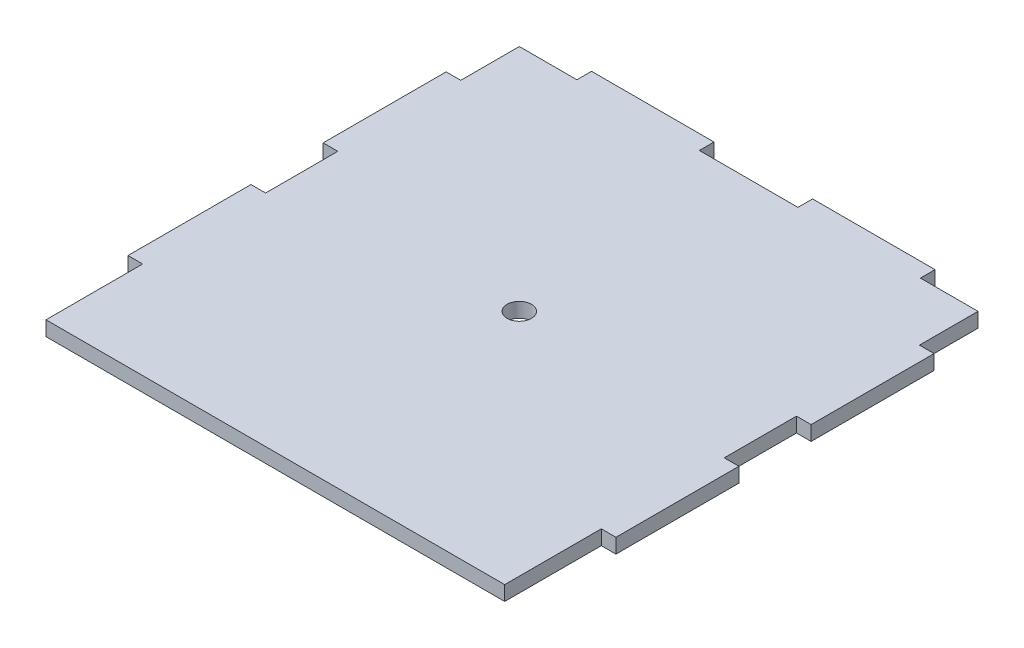
ISO-10303-21;
HEADER;
FILE_DESCRIPTION(('STEP AP214'),'2;1');
FILE_NAME('part.step','',(''),(''),'','','');
FILE_SCHEMA(('AUTOMOTIVE_DESIGN { 1 0 10303 214 1 1 1 1 }'));
ENDSEC;
DATA;
#1=APPLICATION_CONTEXT('core data for automotive mechanical design processes');
#2=APPLICATION_PROTOCOL_DEFINITION('international standard','automotive_design',2000,#1);
#3=PRODUCT_CONTEXT('',#1,'mechanical');
#4=PRODUCT('Part','Part','',(#3));
#5=PRODUCT_RELATED_PRODUCT_CATEGORY('part','',(#4));
#6=PRODUCT_DEFINITION_FORMATION('','',#4);
#7=PRODUCT_DEFINITION_CONTEXT('part definition',#1,'design');
#8=PRODUCT_DEFINITION('design','',#6,#7);
#9=PRODUCT_DEFINITION_SHAPE('','',#8);
#10=(LENGTH_UNIT() NAMED_UNIT(*) SI_UNIT(.MILLI.,.METRE.));
#11=(NAMED_UNIT(*) PLANE_ANGLE_UNIT() SI_UNIT($,.RADIAN.));
#12=(NAMED_UNIT(*) SI_UNIT($,.STERADIAN.) SOLID_ANGLE_UNIT());
#13=UNCERTAINTY_MEASURE_WITH_UNIT(LENGTH_MEASURE(1.E-05),#10,'distance_accuracy_value','');
#14=(GEOMETRIC_REPRESENTATION_CONTEXT(3) GLOBAL_UNCERTAINTY_ASSIGNED_CONTEXT((#13)) GLOBAL_UNIT_ASSIGNED_CONTEXT((#10,
#11,#12)) REPRESENTATION_CONTEXT('',''));
#15=CARTESIAN_POINT('',(0.,0.,0.));
#16=DIRECTION('',(0.,0.,1.));
#17=DIRECTION('',(1.,0.,0.));
#18=AXIS2_PLACEMENT_3D('',#15,#16,#17);
#19=CARTESIAN_POINT('',(0.,3.,-97.));
#20=DIRECTION('',(0.,0.,-1.));
#21=DIRECTION('',(-1.,0.,0.));
#22=AXIS2_PLACEMENT_3D('',#19,#20,#21);
#23=PLANE('',#22);
#24=DIRECTION('',(1.,0.,0.));
#25=VECTOR('',#24,1.);
#26=CARTESIAN_POINT('',(0.,0.,-97.));
#27=LINE('',#26,#25);
#28=CARTESIAN_POINT('',(2.99999999999999,0.,-97.));
#29=VERTEX_POINT('',#28);
#30=CARTESIAN_POINT('',(14.8,0.,-97.));
#31=VERTEX_POINT('',#30);
#32=EDGE_CURVE('E392',#29,#31,#27,.T.);
#33=ORIENTED_EDGE('',*,*,#32,.F.);
#34=DIRECTION('',(0.,-1.,0.));
#35=VECTOR('',#34,1.);
#36=CARTESIAN_POINT('',(2.99999999999999,3.,-97.));
#37=LINE('',#36,#35);
#38=CARTESIAN_POINT('',(2.99999999999999,3.,-97.));
#39=VERTEX_POINT('',#38);
#40=EDGE_CURVE('E11',#39,#29,#37,.T.);
#41=ORIENTED_EDGE('',*,*,#40,.F.);
#42=DIRECTION('',(1.,0.,0.));
#43=VECTOR('',#42,1.);
#44=CARTESIAN_POINT('',(0.,3.,-97.));
#45=LINE('',#44,#43);
#46=CARTESIAN_POINT('',(14.8,3.,-97.));
#47=VERTEX_POINT('',#46);
#48=EDGE_CURVE('E311',#39,#47,#45,.T.);
#49=ORIENTED_EDGE('',*,*,#48,.T.);
#50=DIRECTION('',(0.,-1.,0.));
#51=VECTOR('',#50,1.);
#52=CARTESIAN_POINT('',(14.8,3.,-97.));
#53=LINE('',#52,#51);
#54=EDGE_CURVE('E53',#47,#31,#53,.T.);
#55=ORIENTED_EDGE('',*,*,#54,.T.);
#56=EDGE_LOOP('',(#33,#41,#49,#55));
#57=FACE_BOUND('',#56,.T.);
#58=ADVANCED_FACE('F36',(#57),#23,.T.);
#59=CARTESIAN_POINT('',(3.00000000000066,3.,0.));
#60=DIRECTION('',(1.,0.,0.));
#61=DIRECTION('',(0.,0.,-1.));
#62=AXIS2_PLACEMENT_3D('',#59,#60,#61);
#63=PLANE('',#62);
#64=DIRECTION('',(0.,0.,1.));
#65=VECTOR('',#64,1.);
#66=CARTESIAN_POINT('',(3.00000000000066,0.,0.));
#67=LINE('',#66,#65);
#68=CARTESIAN_POINT('',(3.00000000000007,0.,-84.9999999999998));
#69=VERTEX_POINT('',#68);
#70=EDGE_CURVE('E390',#29,#69,#67,.T.);
#71=ORIENTED_EDGE('',*,*,#70,.T.);
#72=DIRECTION('',(0.,-1.,0.));
#73=VECTOR('',#72,1.);
#74=CARTESIAN_POINT('',(3.00000000000007,3.,-84.9999999999998));
#75=LINE('',#74,#73);
#76=CARTESIAN_POINT('',(3.00000000000007,3.,-84.9999999999998));
#77=VERTEX_POINT('',#76);
#78=EDGE_CURVE('E45',#77,#69,#75,.T.);
#79=ORIENTED_EDGE('',*,*,#78,.F.);
#80=DIRECTION('',(0.,0.,1.));
#81=VECTOR('',#80,1.);
#82=CARTESIAN_POINT('',(3.00000000000066,3.,0.));
#83=LINE('',#82,#81);
#84=EDGE_CURVE('E308',#39,#77,#83,.T.);
#85=ORIENTED_EDGE('',*,*,#84,.F.);
#86=ORIENTED_EDGE('',*,*,#40,.T.);
#87=EDGE_LOOP('',(#71,#79,#85,#86));
#88=FACE_BOUND('',#87,.T.);
#89=ADVANCED_FACE('F391',(#88),#63,.F.);
#90=CARTESIAN_POINT('',(-6.29126380620918E-12,3.,-84.9999999999995));
#91=DIRECTION('',(0.,0.,1.));
#92=DIRECTION('',(1.,0.,0.));
#93=AXIS2_PLACEMENT_3D('',#90,#91,#92);
#94=PLANE('',#93);
#95=DIRECTION('',(-1.,0.,0.));
#96=VECTOR('',#95,1.);
#97=CARTESIAN_POINT('',(-6.29126380620918E-12,0.,-84.9999999999995));
#98=LINE('',#97,#96);
#99=CARTESIAN_POINT('',(0.,0.,-84.9999999999997));
#100=VERTEX_POINT('',#99);
#101=EDGE_CURVE('E386',#69,#100,#98,.T.);
#102=ORIENTED_EDGE('',*,*,#101,.T.);
#103=DIRECTION('',(0.,-1.,0.));
#104=VECTOR('',#103,1.);
#105=CARTESIAN_POINT('',(0.,3.,-84.9999999999997));
#106=LINE('',#105,#104);
#107=CARTESIAN_POINT('',(0.,3.,-84.9999999999997));
#108=VERTEX_POINT('',#107);
#109=EDGE_CURVE('E378',#108,#100,#106,.T.);
#110=ORIENTED_EDGE('',*,*,#109,.F.);
#111=DIRECTION('',(-1.,0.,0.));
#112=VECTOR('',#111,1.);
#113=CARTESIAN_POINT('',(-6.29126380620918E-12,3.,-84.9999999999995));
#114=LINE('',#113,#112);
#115=EDGE_CURVE('E306',#77,#108,#114,.T.);
#116=ORIENTED_EDGE('',*,*,#115,.F.);
#117=ORIENTED_EDGE('',*,*,#78,.T.);
#118=EDGE_LOOP('',(#102,#110,#116,#117));
#119=FACE_BOUND('',#118,.T.);
#120=ADVANCED_FACE('F384',(#119),#94,.F.);
#121=CARTESIAN_POINT('',(0.,3.,0.));
#122=DIRECTION('',(-1.,0.,0.));
#123=DIRECTION('',(0.,0.,1.));
#124=AXIS2_PLACEMENT_3D('',#121,#122,#123);
#125=PLANE('',#124);
#126=DIRECTION('',(0.,0.,-1.));
#127=VECTOR('',#126,1.);
#128=CARTESIAN_POINT('',(0.,0.,0.));
#129=LINE('',#128,#127);
#130=CARTESIAN_POINT('',(0.,0.,-59.7999999999997));
#131=VERTEX_POINT('',#130);
#132=EDGE_CURVE('E394',#131,#100,#129,.T.);
#133=ORIENTED_EDGE('',*,*,#132,.F.);
#134=DIRECTION('',(0.,-1.,0.));
#135=VECTOR('',#134,1.);
#136=CARTESIAN_POINT('',(0.,3.,-59.7999999999997));
#137=LINE('',#136,#135);
#138=CARTESIAN_POINT('',(0.,3.,-59.7999999999997));
#139=VERTEX_POINT('',#138);
#140=EDGE_CURVE('E376',#139,#131,#137,.T.);
#141=ORIENTED_EDGE('',*,*,#140,.F.);
#142=DIRECTION('',(0.,0.,-1.));
#143=VECTOR('',#142,1.);
#144=CARTESIAN_POINT('',(0.,3.,0.));
#145=LINE('',#144,#143);
#146=EDGE_CURVE('E303',#139,#108,#145,.T.);
#147=ORIENTED_EDGE('',*,*,#146,.T.);
#148=ORIENTED_EDGE('',*,*,#109,.T.);
#149=EDGE_LOOP('',(#133,#141,#147,#148));
#150=FACE_BOUND('',#149,.T.);
#151=ADVANCED_FACE('F478',(#150),#125,.T.);
#152=CARTESIAN_POINT('',(-4.42608912483892E-12,3.,-59.7999999999996));
#153=DIRECTION('',(0.,0.,-1.));
#154=DIRECTION('',(-1.,0.,0.));
#155=AXIS2_PLACEMENT_3D('',#152,#153,#154);
#156=PLANE('',#155);
#157=DIRECTION('',(1.,0.,0.));
#158=VECTOR('',#157,1.);
#159=CARTESIAN_POINT('',(-4.42608912483892E-12,0.,-59.7999999999996));
#160=LINE('',#159,#158);
#161=CARTESIAN_POINT('',(3.00000000000022,0.,-59.7999999999998));
#162=VERTEX_POINT('',#161);
#163=EDGE_CURVE('E401',#131,#162,#160,.T.);
#164=ORIENTED_EDGE('',*,*,#163,.T.);
#165=DIRECTION('',(0.,-1.,0.));
#166=VECTOR('',#165,1.);
#167=CARTESIAN_POINT('',(3.00000000000022,3.,-59.7999999999998));
#168=LINE('',#167,#166);
#169=CARTESIAN_POINT('',(3.00000000000022,3.,-59.7999999999998));
#170=VERTEX_POINT('',#169);
#171=EDGE_CURVE('E374',#170,#162,#168,.T.);
#172=ORIENTED_EDGE('',*,*,#171,.F.);
#173=DIRECTION('',(1.,0.,0.));
#174=VECTOR('',#173,1.);
#175=CARTESIAN_POINT('',(-4.42608912483892E-12,3.,-59.7999999999996));
#176=LINE('',#175,#174);
#177=EDGE_CURVE('E301',#139,#170,#176,.T.);
#178=ORIENTED_EDGE('',*,*,#177,.F.);
#179=ORIENTED_EDGE('',*,*,#140,.T.);
#180=EDGE_LOOP('',(#164,#172,#178,#179));
#181=FACE_BOUND('',#180,.T.);
#182=ADVANCED_FACE('F479',(#181),#156,.F.);
#183=CARTESIAN_POINT('',(3.00000000000067,3.,0.));
#184=DIRECTION('',(-1.,0.,0.));
#185=DIRECTION('',(0.,0.,1.));
#186=AXIS2_PLACEMENT_3D('',#183,#184,#185);
#187=PLANE('',#186);
#188=DIRECTION('',(0.,0.,-1.));
#189=VECTOR('',#188,1.);
#190=CARTESIAN_POINT('',(3.00000000000067,0.,0.));
#191=LINE('',#190,#189);
#192=CARTESIAN_POINT('',(3.00000000000034,0.,-44.9999999999998));
#193=VERTEX_POINT('',#192);
#194=EDGE_CURVE('E405',#193,#162,#191,.T.);
#195=ORIENTED_EDGE('',*,*,#194,.F.);
#196=DIRECTION('',(0.,-1.,0.));
#197=VECTOR('',#196,1.);
#198=CARTESIAN_POINT('',(3.00000000000034,3.,-44.9999999999998));
#199=LINE('',#198,#197);
#200=CARTESIAN_POINT('',(3.00000000000034,3.,-44.9999999999998));
#201=VERTEX_POINT('',#200);
#202=EDGE_CURVE('E372',#201,#193,#199,.T.);
#203=ORIENTED_EDGE('',*,*,#202,.F.);
#204=DIRECTION('',(0.,0.,-1.));
#205=VECTOR('',#204,1.);
#206=CARTESIAN_POINT('',(3.00000000000067,3.,0.));
#207=LINE('',#206,#205);
#208=EDGE_CURVE('E298',#201,#170,#207,.T.);
#209=ORIENTED_EDGE('',*,*,#208,.T.);
#210=ORIENTED_EDGE('',*,*,#171,.T.);
#211=EDGE_LOOP('',(#195,#203,#209,#210));
#212=FACE_BOUND('',#211,.T.);
#213=ADVANCED_FACE('F482',(#212),#187,.T.);
#214=CARTESIAN_POINT('',(-3.33066907387543E-12,3.,-44.9999999999996));
#215=DIRECTION('',(0.,0.,-1.));
#216=DIRECTION('',(-1.,0.,0.));
#217=AXIS2_PLACEMENT_3D('',#214,#215,#216);
#218=PLANE('',#217);
#219=DIRECTION('',(1.,0.,0.));
#220=VECTOR('',#219,1.);
#221=CARTESIAN_POINT('',(-3.33066907387543E-12,0.,-44.9999999999996));
#222=LINE('',#221,#220);
#223=CARTESIAN_POINT('',(0.,0.,-44.9999999999997));
#224=VERTEX_POINT('',#223);
#225=EDGE_CURVE('E408',#224,#193,#222,.T.);
#226=ORIENTED_EDGE('',*,*,#225,.F.);
#227=DIRECTION('',(0.,-1.,0.));
#228=VECTOR('',#227,1.);
#229=CARTESIAN_POINT('',(0.,3.,-44.9999999999997));
#230=LINE('',#229,#228);
#231=CARTESIAN_POINT('',(0.,3.,-44.9999999999997));
#232=VERTEX_POINT('',#231);
#233=EDGE_CURVE('E370',#232,#224,#230,.T.);
#234=ORIENTED_EDGE('',*,*,#233,.F.);
#235=DIRECTION('',(1.,0.,0.));
#236=VECTOR('',#235,1.);
#237=CARTESIAN_POINT('',(-3.33066907387543E-12,3.,-44.9999999999996));
#238=LINE('',#237,#236);
#239=EDGE_CURVE('E295',#232,#201,#238,.T.);
#240=ORIENTED_EDGE('',*,*,#239,.T.);
#241=ORIENTED_EDGE('',*,*,#202,.T.);
#242=EDGE_LOOP('',(#226,#234,#240,#241));
#243=FACE_BOUND('',#242,.T.);
#244=ADVANCED_FACE('F486',(#243),#218,.T.);
#245=CARTESIAN_POINT('',(0.,0.,-19.7999999999997));
#246=VERTEX_POINT('',#245);
#247=EDGE_CURVE('E402',#246,#224,#129,.T.);
#248=ORIENTED_EDGE('',*,*,#247,.F.);
#249=DIRECTION('',(0.,-1.,0.));
#250=VECTOR('',#249,1.);
#251=CARTESIAN_POINT('',(0.,3.,-19.7999999999997));
#252=LINE('',#251,#250);
#253=CARTESIAN_POINT('',(0.,3.,-19.7999999999997));
#254=VERTEX_POINT('',#253);
#255=EDGE_CURVE('E368',#254,#246,#252,.T.);
#256=ORIENTED_EDGE('',*,*,#255,.F.);
#257=EDGE_CURVE('E294',#254,#232,#145,.T.);
#258=ORIENTED_EDGE('',*,*,#257,.T.);
#259=ORIENTED_EDGE('',*,*,#233,.T.);
#260=EDGE_LOOP('',(#248,#256,#258,#259));
#261=FACE_BOUND('',#260,.T.);
#262=ADVANCED_FACE('F490',(#261),#125,.T.);
#263=CARTESIAN_POINT('',(-1.44259604262228E-12,3.,-19.7999999999996));
#264=DIRECTION('',(0.,0.,1.));
#265=DIRECTION('',(1.,0.,0.));
#266=AXIS2_PLACEMENT_3D('',#263,#264,#265);
#267=PLANE('',#266);
#268=DIRECTION('',(-1.,0.,0.));
#269=VECTOR('',#268,1.);
#270=CARTESIAN_POINT('',(-1.44259604262228E-12,0.,-19.7999999999996));
#271=LINE('',#270,#269);
#272=CARTESIAN_POINT('',(3.0000000000005,0.,-19.7999999999998));
#273=VERTEX_POINT('',#272);
#274=EDGE_CURVE('E411',#273,#246,#271,.T.);
#275=ORIENTED_EDGE('',*,*,#274,.F.);
#276=DIRECTION('',(0.,-1.,0.));
#277=VECTOR('',#276,1.);
#278=CARTESIAN_POINT('',(3.0000000000005,3.,-19.7999999999998));
#279=LINE('',#278,#277);
#280=CARTESIAN_POINT('',(3.0000000000005,3.,-19.7999999999998));
#281=VERTEX_POINT('',#280);
#282=EDGE_CURVE('E366',#281,#273,#279,.T.);
#283=ORIENTED_EDGE('',*,*,#282,.F.);
#284=DIRECTION('',(-1.,0.,0.));
#285=VECTOR('',#284,1.);
#286=CARTESIAN_POINT('',(-1.44259604262228E-12,3.,-19.7999999999996));
#287=LINE('',#286,#285);
#288=EDGE_CURVE('E291',#281,#254,#287,.T.);
#289=ORIENTED_EDGE('',*,*,#288,.T.);
#290=ORIENTED_EDGE('',*,*,#255,.T.);
#291=EDGE_LOOP('',(#275,#283,#289,#290));
#292=FACE_BOUND('',#291,.T.);
#293=ADVANCED_FACE('F494',(#292),#267,.T.);
#294=CARTESIAN_POINT('',(3.00000000000064,3.,0.));
#295=DIRECTION('',(-1.,0.,0.));
#296=DIRECTION('',(0.,0.,1.));
#297=AXIS2_PLACEMENT_3D('',#294,#295,#296);
#298=PLANE('',#297);
#299=DIRECTION('',(0.,0.,-1.));
#300=VECTOR('',#299,1.);
#301=CARTESIAN_POINT('',(3.00000000000064,0.,0.));
#302=LINE('',#301,#300);
#303=CARTESIAN_POINT('',(3.00000000000064,0.,0.));
#304=VERTEX_POINT('',#303);
#305=EDGE_CURVE('E414',#304,#273,#302,.T.);
#306=ORIENTED_EDGE('',*,*,#305,.F.);
#307=DIRECTION('',(0.,-1.,0.));
#308=VECTOR('',#307,1.);
#309=CARTESIAN_POINT('',(3.00000000000064,3.,0.));
#310=LINE('',#309,#308);
#311=CARTESIAN_POINT('',(3.00000000000064,3.,0.));
#312=VERTEX_POINT('',#311);
#313=EDGE_CURVE('E364',#312,#304,#310,.T.);
#314=ORIENTED_EDGE('',*,*,#313,.F.);
#315=DIRECTION('',(0.,0.,-1.));
#316=VECTOR('',#315,1.);
#317=CARTESIAN_POINT('',(3.00000000000064,3.,0.));
#318=LINE('',#317,#316);
#319=EDGE_CURVE('E288',#312,#281,#318,.T.);
#320=ORIENTED_EDGE('',*,*,#319,.T.);
#321=ORIENTED_EDGE('',*,*,#282,.T.);
#322=EDGE_LOOP('',(#306,#314,#320,#321));
#323=FACE_BOUND('',#322,.T.);
#324=ADVANCED_FACE('F498',(#323),#298,.T.);
#325=CARTESIAN_POINT('',(0.,3.,0.));
#326=DIRECTION('',(0.,0.,-1.));
#327=DIRECTION('',(-1.,0.,0.));
#328=AXIS2_PLACEMENT_3D('',#325,#326,#327);
#329=PLANE('',#328);
#330=DIRECTION('',(1.,0.,0.));
#331=VECTOR('',#330,1.);
#332=CARTESIAN_POINT('',(0.,0.,0.));
#333=LINE('',#332,#331);
#334=CARTESIAN_POINT('',(97.,0.,0.));
#335=VERTEX_POINT('',#334);
#336=EDGE_CURVE('E417',#304,#335,#333,.T.);
#337=ORIENTED_EDGE('',*,*,#336,.T.);
#338=DIRECTION('',(0.,-1.,0.));
#339=VECTOR('',#338,1.);
#340=CARTESIAN_POINT('',(97.,3.,0.));
#341=LINE('',#340,#339);
#342=CARTESIAN_POINT('',(97.,3.,0.));
#343=VERTEX_POINT('',#342);
#344=EDGE_CURVE('E361',#343,#335,#341,.T.);
#345=ORIENTED_EDGE('',*,*,#344,.F.);
#346=DIRECTION('',(1.,0.,0.));
#347=VECTOR('',#346,1.);
#348=CARTESIAN_POINT('',(0.,3.,0.));
#349=LINE('',#348,#347);
#350=EDGE_CURVE('E285',#312,#343,#349,.T.);
#351=ORIENTED_EDGE('',*,*,#350,.F.);
#352=ORIENTED_EDGE('',*,*,#313,.T.);
#353=EDGE_LOOP('',(#337,#345,#351,#352));
#354=FACE_BOUND('',#353,.T.);
#355=ADVANCED_FACE('F502',(#354),#329,.F.);
#356=CARTESIAN_POINT('',(97.,3.,0.));
#357=DIRECTION('',(-1.,0.,0.));
#358=DIRECTION('',(0.,0.,1.));
#359=AXIS2_PLACEMENT_3D('',#356,#357,#358);
#360=PLANE('',#359);
#361=DIRECTION('',(0.,0.,-1.));
#362=VECTOR('',#361,1.);
#363=CARTESIAN_POINT('',(97.,0.,0.));
#364=LINE('',#363,#362);
#365=CARTESIAN_POINT('',(97.,0.,-19.8));
#366=VERTEX_POINT('',#365);
#367=EDGE_CURVE('E420',#335,#366,#364,.T.);
#368=ORIENTED_EDGE('',*,*,#367,.T.);
#369=DIRECTION('',(0.,-1.,0.));
#370=VECTOR('',#369,1.);
#371=CARTESIAN_POINT('',(97.,3.,-19.8));
#372=LINE('',#371,#370);
#373=CARTESIAN_POINT('',(97.,3.,-19.8));
#374=VERTEX_POINT('',#373);
#375=EDGE_CURVE('E358',#374,#366,#372,.T.);
#376=ORIENTED_EDGE('',*,*,#375,.F.);
#377=DIRECTION('',(0.,0.,-1.));
#378=VECTOR('',#377,1.);
#379=CARTESIAN_POINT('',(97.,3.,0.));
#380=LINE('',#379,#378);
#381=EDGE_CURVE('E282',#343,#374,#380,.T.);
#382=ORIENTED_EDGE('',*,*,#381,.F.);
#383=ORIENTED_EDGE('',*,*,#344,.T.);
#384=EDGE_LOOP('',(#368,#376,#382,#383));
#385=FACE_BOUND('',#384,.T.);
#386=ADVANCED_FACE('F506',(#385),#360,.F.);
#387=CARTESIAN_POINT('',(0.,3.,-19.7999999999999));
#388=DIRECTION('',(0.,0.,-1.));
#389=DIRECTION('',(-1.,0.,0.));
#390=AXIS2_PLACEMENT_3D('',#387,#388,#389);
#391=PLANE('',#390);
#392=DIRECTION('',(1.,0.,0.));
#393=VECTOR('',#392,1.);
#394=CARTESIAN_POINT('',(0.,0.,-19.7999999999999));
#395=LINE('',#394,#393);
#396=CARTESIAN_POINT('',(100.,0.,-19.8));
#397=VERTEX_POINT('',#396);
#398=EDGE_CURVE('E423',#366,#397,#395,.T.);
#399=ORIENTED_EDGE('',*,*,#398,.T.);
#400=DIRECTION('',(0.,-1.,0.));
#401=VECTOR('',#400,1.);
#402=CARTESIAN_POINT('',(100.,3.,-19.8));
#403=LINE('',#402,#401);
#404=CARTESIAN_POINT('',(100.,3.,-19.8));
#405=VERTEX_POINT('',#404);
#406=EDGE_CURVE('E355',#405,#397,#403,.T.);
#407=ORIENTED_EDGE('',*,*,#406,.F.);
#408=DIRECTION('',(1.,0.,0.));
#409=VECTOR('',#408,1.);
#410=CARTESIAN_POINT('',(0.,3.,-19.7999999999999));
#411=LINE('',#410,#409);
#412=EDGE_CURVE('E279',#374,#405,#411,.T.);
#413=ORIENTED_EDGE('',*,*,#412,.F.);
#414=ORIENTED_EDGE('',*,*,#375,.T.);
#415=EDGE_LOOP('',(#399,#407,#413,#414));
#416=FACE_BOUND('',#415,.T.);
#417=ADVANCED_FACE('F510',(#416),#391,.F.);
#418=CARTESIAN_POINT('',(100.,3.,0.));
#419=DIRECTION('',(-1.,0.,0.));
#420=DIRECTION('',(0.,0.,1.));
#421=AXIS2_PLACEMENT_3D('',#418,#419,#420);
#422=PLANE('',#421);
#423=DIRECTION('',(0.,0.,-1.));
#424=VECTOR('',#423,1.);
#425=CARTESIAN_POINT('',(100.,0.,0.));
#426=LINE('',#425,#424);
#427=CARTESIAN_POINT('',(100.,0.,-45.));
#428=VERTEX_POINT('',#427);
#429=EDGE_CURVE('E426',#397,#428,#426,.T.);
#430=ORIENTED_EDGE('',*,*,#429,.T.);
#431=DIRECTION('',(0.,-1.,0.));
#432=VECTOR('',#431,1.);
#433=CARTESIAN_POINT('',(100.,3.,-45.));
#434=LINE('',#433,#432);
#435=CARTESIAN_POINT('',(100.,3.,-45.));
#436=VERTEX_POINT('',#435);
#437=EDGE_CURVE('E352',#436,#428,#434,.T.);
#438=ORIENTED_EDGE('',*,*,#437,.F.);
#439=DIRECTION('',(0.,0.,-1.));
#440=VECTOR('',#439,1.);
#441=CARTESIAN_POINT('',(100.,3.,0.));
#442=LINE('',#441,#440);
#443=EDGE_CURVE('E276',#405,#436,#442,.T.);
#444=ORIENTED_EDGE('',*,*,#443,.F.);
#445=ORIENTED_EDGE('',*,*,#406,.T.);
#446=EDGE_LOOP('',(#430,#438,#444,#445));
#447=FACE_BOUND('',#446,.T.);
#448=ADVANCED_FACE('F514',(#447),#422,.F.);
#449=CARTESIAN_POINT('',(0.,3.,-45.));
#450=DIRECTION('',(0.,0.,1.));
#451=DIRECTION('',(1.,0.,0.));
#452=AXIS2_PLACEMENT_3D('',#449,#450,#451);
#453=PLANE('',#452);
#454=DIRECTION('',(-1.,0.,0.));
#455=VECTOR('',#454,1.);
#456=CARTESIAN_POINT('',(0.,0.,-45.));
#457=LINE('',#456,#455);
#458=CARTESIAN_POINT('',(97.,0.,-45.));
#459=VERTEX_POINT('',#458);
#460=EDGE_CURVE('E429',#428,#459,#457,.T.);
#461=ORIENTED_EDGE('',*,*,#460,.T.);
#462=DIRECTION('',(0.,-1.,0.));
#463=VECTOR('',#462,1.);
#464=CARTESIAN_POINT('',(97.,3.,-45.));
#465=LINE('',#464,#463);
#466=CARTESIAN_POINT('',(97.,3.,-45.));
#467=VERTEX_POINT('',#466);
#468=EDGE_CURVE('E349',#467,#459,#465,.T.);
#469=ORIENTED_EDGE('',*,*,#468,.F.);
#470=DIRECTION('',(-1.,0.,0.));
#471=VECTOR('',#470,1.);
#472=CARTESIAN_POINT('',(0.,3.,-45.));
#473=LINE('',#472,#471);
#474=EDGE_CURVE('E273',#436,#467,#473,.T.);
#475=ORIENTED_EDGE('',*,*,#474,.F.);
#476=ORIENTED_EDGE('',*,*,#437,.T.);
#477=EDGE_LOOP('',(#461,#469,#475,#476));
#478=FACE_BOUND('',#477,.T.);
#479=ADVANCED_FACE('F516',(#478),#453,.F.);
#480=CARTESIAN_POINT('',(97.,3.,0.));
#481=DIRECTION('',(-1.,0.,0.));
#482=DIRECTION('',(0.,0.,1.));
#483=AXIS2_PLACEMENT_3D('',#480,#481,#482);
#484=PLANE('',#483);
#485=DIRECTION('',(0.,0.,-1.));
#486=VECTOR('',#485,1.);
#487=CARTESIAN_POINT('',(97.,0.,0.));
#488=LINE('',#487,#486);
#489=CARTESIAN_POINT('',(97.,0.,-59.8));
#490=VERTEX_POINT('',#489);
#491=EDGE_CURVE('E433',#459,#490,#488,.T.);
#492=ORIENTED_EDGE('',*,*,#491,.T.);
#493=DIRECTION('',(0.,-1.,0.));
#494=VECTOR('',#493,1.);
#495=CARTESIAN_POINT('',(97.,3.,-59.8));
#496=LINE('',#495,#494);
#497=CARTESIAN_POINT('',(97.,3.,-59.8));
#498=VERTEX_POINT('',#497);
#499=EDGE_CURVE('E347',#498,#490,#496,.T.);
#500=ORIENTED_EDGE('',*,*,#499,.F.);
#501=DIRECTION('',(0.,0.,-1.));
#502=VECTOR('',#501,1.);
#503=CARTESIAN_POINT('',(97.,3.,0.));
#504=LINE('',#503,#502);
#505=EDGE_CURVE('E271',#467,#498,#504,.T.);
#506=ORIENTED_EDGE('',*,*,#505,.F.);
#507=ORIENTED_EDGE('',*,*,#468,.T.);
#508=EDGE_LOOP('',(#492,#500,#506,#507));
#509=FACE_BOUND('',#508,.T.);
#510=ADVANCED_FACE('F519',(#509),#484,.F.);
#511=CARTESIAN_POINT('',(0.,3.,-59.8));
#512=DIRECTION('',(0.,0.,1.));
#513=DIRECTION('',(1.,0.,0.));
#514=AXIS2_PLACEMENT_3D('',#511,#512,#513);
#515=PLANE('',#514);
#516=DIRECTION('',(-1.,0.,0.));
#517=VECTOR('',#516,1.);
#518=CARTESIAN_POINT('',(0.,0.,-59.8));
#519=LINE('',#518,#517);
#520=CARTESIAN_POINT('',(100.,0.,-59.8));
#521=VERTEX_POINT('',#520);
#522=EDGE_CURVE('E436',#521,#490,#519,.T.);
#523=ORIENTED_EDGE('',*,*,#522,.F.);
#524=DIRECTION('',(0.,-1.,0.));
#525=VECTOR('',#524,1.);
#526=CARTESIAN_POINT('',(100.,3.,-59.8));
#527=LINE('',#526,#525);
#528=CARTESIAN_POINT('',(100.,3.,-59.8));
#529=VERTEX_POINT('',#528);
#530=EDGE_CURVE('E345',#529,#521,#527,.T.);
#531=ORIENTED_EDGE('',*,*,#530,.F.);
#532=DIRECTION('',(-1.,0.,0.));
#533=VECTOR('',#532,1.);
#534=CARTESIAN_POINT('',(0.,3.,-59.8));
#535=LINE('',#534,#533);
#536=EDGE_CURVE('E268',#529,#498,#535,.T.);
#537=ORIENTED_EDGE('',*,*,#536,.T.);
#538=ORIENTED_EDGE('',*,*,#499,.T.);
#539=EDGE_LOOP('',(#523,#531,#537,#538));
#540=FACE_BOUND('',#539,.T.);
#541=ADVANCED_FACE('F523',(#540),#515,.T.);
#542=CARTESIAN_POINT('',(100.,0.,-85.));
#543=VERTEX_POINT('',#542);
#544=EDGE_CURVE('E430',#521,#543,#426,.T.);
#545=ORIENTED_EDGE('',*,*,#544,.T.);
#546=DIRECTION('',(0.,-1.,0.));
#547=VECTOR('',#546,1.);
#548=CARTESIAN_POINT('',(100.,3.,-85.));
#549=LINE('',#548,#547);
#550=CARTESIAN_POINT('',(100.,3.,-85.));
#551=VERTEX_POINT('',#550);
#552=EDGE_CURVE('E343',#551,#543,#549,.T.);
#553=ORIENTED_EDGE('',*,*,#552,.F.);
#554=EDGE_CURVE('E267',#529,#551,#442,.T.);
#555=ORIENTED_EDGE('',*,*,#554,.F.);
#556=ORIENTED_EDGE('',*,*,#530,.T.);
#557=EDGE_LOOP('',(#545,#553,#555,#556));
#558=FACE_BOUND('',#557,.T.);
#559=ADVANCED_FACE('F527',(#558),#422,.F.);
#560=CARTESIAN_POINT('',(0.,3.,-85.));
#561=DIRECTION('',(0.,0.,-1.));
#562=DIRECTION('',(-1.,0.,0.));
#563=AXIS2_PLACEMENT_3D('',#560,#561,#562);
#564=PLANE('',#563);
#565=DIRECTION('',(1.,0.,0.));
#566=VECTOR('',#565,1.);
#567=CARTESIAN_POINT('',(0.,0.,-85.));
#568=LINE('',#567,#566);
#569=CARTESIAN_POINT('',(97.,0.,-85.));
#570=VERTEX_POINT('',#569);
#571=EDGE_CURVE('E439',#570,#543,#568,.T.);
#572=ORIENTED_EDGE('',*,*,#571,.F.);
#573=DIRECTION('',(0.,-1.,0.));
#574=VECTOR('',#573,1.);
#575=CARTESIAN_POINT('',(97.,3.,-85.));
#576=LINE('',#575,#574);
#577=CARTESIAN_POINT('',(97.,3.,-85.));
#578=VERTEX_POINT('',#577);
#579=EDGE_CURVE('E341',#578,#570,#576,.T.);
#580=ORIENTED_EDGE('',*,*,#579,.F.);
#581=DIRECTION('',(1.,0.,0.));
#582=VECTOR('',#581,1.);
#583=CARTESIAN_POINT('',(0.,3.,-85.));
#584=LINE('',#583,#582);
#585=EDGE_CURVE('E264',#578,#551,#584,.T.);
#586=ORIENTED_EDGE('',*,*,#585,.T.);
#587=ORIENTED_EDGE('',*,*,#552,.T.);
#588=EDGE_LOOP('',(#572,#580,#586,#587));
#589=FACE_BOUND('',#588,.T.);
#590=ADVANCED_FACE('F531',(#589),#564,.T.);
#591=CARTESIAN_POINT('',(97.,3.,0.));
#592=DIRECTION('',(1.,0.,0.));
#593=DIRECTION('',(0.,0.,-1.));
#594=AXIS2_PLACEMENT_3D('',#591,#592,#593);
#595=PLANE('',#594);
#596=DIRECTION('',(0.,0.,1.));
#597=VECTOR('',#596,1.);
#598=CARTESIAN_POINT('',(97.,0.,0.));
#599=LINE('',#598,#597);
#600=CARTESIAN_POINT('',(97.,0.,-97.0000000000004));
#601=VERTEX_POINT('',#600);
#602=EDGE_CURVE('E442',#601,#570,#599,.T.);
#603=ORIENTED_EDGE('',*,*,#602,.F.);
#604=DIRECTION('',(0.,-1.,0.));
#605=VECTOR('',#604,1.);
#606=CARTESIAN_POINT('',(97.,3.,-97.0000000000004));
#607=LINE('',#606,#605);
#608=CARTESIAN_POINT('',(97.,3.,-97.0000000000004));
#609=VERTEX_POINT('',#608);
#610=EDGE_CURVE('E339',#609,#601,#607,.T.);
#611=ORIENTED_EDGE('',*,*,#610,.F.);
#612=DIRECTION('',(0.,0.,1.));
#613=VECTOR('',#612,1.);
#614=CARTESIAN_POINT('',(97.,3.,0.));
#615=LINE('',#614,#613);
#616=EDGE_CURVE('E259',#609,#578,#615,.T.);
#617=ORIENTED_EDGE('',*,*,#616,.T.);
#618=ORIENTED_EDGE('',*,*,#579,.T.);
#619=EDGE_LOOP('',(#603,#611,#617,#618));
#620=FACE_BOUND('',#619,.T.);
#621=ADVANCED_FACE('F535',(#620),#595,.T.);
#622=CARTESIAN_POINT('',(-1.45529234308972E-12,3.,-96.9999999999989));
#623=DIRECTION('',(0.,0.,1.));
#624=DIRECTION('',(1.,0.,0.));
#625=AXIS2_PLACEMENT_3D('',#622,#623,#624);
#626=PLANE('',#625);
#627=DIRECTION('',(-1.,0.,0.));
#628=VECTOR('',#627,1.);
#629=CARTESIAN_POINT('',(-1.45529234308972E-12,0.,-96.9999999999989));
#630=LINE('',#629,#628);
#631=CARTESIAN_POINT('',(85.2,0.,-97.0000000000002));
#632=VERTEX_POINT('',#631);
#633=EDGE_CURVE('E445',#601,#632,#630,.T.);
#634=ORIENTED_EDGE('',*,*,#633,.T.);
#635=DIRECTION('',(0.,-1.,0.));
#636=VECTOR('',#635,1.);
#637=CARTESIAN_POINT('',(85.2,3.,-97.0000000000002));
#638=LINE('',#637,#636);
#639=CARTESIAN_POINT('',(85.2,3.,-97.0000000000002));
#640=VERTEX_POINT('',#639);
#641=EDGE_CURVE('E336',#640,#632,#638,.T.);
#642=ORIENTED_EDGE('',*,*,#641,.F.);
#643=DIRECTION('',(-1.,0.,0.));
#644=VECTOR('',#643,1.);
#645=CARTESIAN_POINT('',(-1.45529234308972E-12,3.,-96.9999999999989));
#646=LINE('',#645,#644);
#647=EDGE_CURVE('E256',#609,#640,#646,.T.);
#648=ORIENTED_EDGE('',*,*,#647,.F.);
#649=ORIENTED_EDGE('',*,*,#610,.T.);
#650=EDGE_LOOP('',(#634,#642,#648,#649));
#651=FACE_BOUND('',#650,.T.);
#652=ADVANCED_FACE('F539',(#651),#626,.F.);
#653=CARTESIAN_POINT('',(85.2000000000009,3.,-7.8825834748381E-13));
#654=DIRECTION('',(-1.,0.,0.));
#655=DIRECTION('',(0.,0.,1.));
#656=AXIS2_PLACEMENT_3D('',#653,#654,#655);
#657=PLANE('',#656);
#658=DIRECTION('',(0.,0.,-1.));
#659=VECTOR('',#658,1.);
#660=CARTESIAN_POINT('',(85.2000000000009,0.,-7.8825834748381E-13));
#661=LINE('',#660,#659);
#662=CARTESIAN_POINT('',(85.2,0.,-100.));
#663=VERTEX_POINT('',#662);
#664=EDGE_CURVE('E448',#632,#663,#661,.T.);
#665=ORIENTED_EDGE('',*,*,#664,.T.);
#666=DIRECTION('',(0.,-1.,0.));
#667=VECTOR('',#666,1.);
#668=CARTESIAN_POINT('',(85.2,3.,-100.));
#669=LINE('',#668,#667);
#670=CARTESIAN_POINT('',(85.2,3.,-100.));
#671=VERTEX_POINT('',#670);
#672=EDGE_CURVE('E334',#671,#663,#669,.T.);
#673=ORIENTED_EDGE('',*,*,#672,.F.);
#674=DIRECTION('',(0.,0.,-1.));
#675=VECTOR('',#674,1.);
#676=CARTESIAN_POINT('',(85.2000000000009,3.,-7.8825834748381E-13));
#677=LINE('',#676,#675);
#678=EDGE_CURVE('E253',#640,#671,#677,.T.);
#679=ORIENTED_EDGE('',*,*,#678,.F.);
#680=ORIENTED_EDGE('',*,*,#641,.T.);
#681=EDGE_LOOP('',(#665,#673,#679,#680));
#682=FACE_BOUND('',#681,.T.);
#683=ADVANCED_FACE('F543',(#682),#657,.F.);
#684=CARTESIAN_POINT('',(0.,3.,-100.));
#685=DIRECTION('',(0.,0.,-1.));
#686=DIRECTION('',(-1.,0.,0.));
#687=AXIS2_PLACEMENT_3D('',#684,#685,#686);
#688=PLANE('',#687);
#689=DIRECTION('',(1.,0.,0.));
#690=VECTOR('',#689,1.);
#691=CARTESIAN_POINT('',(0.,0.,-100.));
#692=LINE('',#691,#690);
#693=CARTESIAN_POINT('',(60.1,0.,-100.));
#694=VERTEX_POINT('',#693);
#695=EDGE_CURVE('E323',#694,#663,#692,.T.);
#696=ORIENTED_EDGE('',*,*,#695,.F.);
#697=DIRECTION('',(0.,-1.,0.));
#698=VECTOR('',#697,1.);
#699=CARTESIAN_POINT('',(60.1,3.,-100.));
#700=LINE('',#699,#698);
#701=CARTESIAN_POINT('',(60.1,3.,-100.));
#702=VERTEX_POINT('',#701);
#703=EDGE_CURVE('E332',#702,#694,#700,.T.);
#704=ORIENTED_EDGE('',*,*,#703,.F.);
#705=DIRECTION('',(1.,0.,0.));
#706=VECTOR('',#705,1.);
#707=CARTESIAN_POINT('',(0.,3.,-100.));
#708=LINE('',#707,#706);
#709=EDGE_CURVE('E247',#702,#671,#708,.T.);
#710=ORIENTED_EDGE('',*,*,#709,.T.);
#711=ORIENTED_EDGE('',*,*,#672,.T.);
#712=EDGE_LOOP('',(#696,#704,#710,#711));
#713=FACE_BOUND('',#712,.T.);
#714=ADVANCED_FACE('F547',(#713),#688,.T.);
#715=CARTESIAN_POINT('',(60.1,3.,0.));
#716=DIRECTION('',(1.,0.,0.));
#717=DIRECTION('',(0.,0.,-1.));
#718=AXIS2_PLACEMENT_3D('',#715,#716,#717);
#719=PLANE('',#718);
#720=DIRECTION('',(0.,0.,1.));
#721=VECTOR('',#720,1.);
#722=CARTESIAN_POINT('',(60.1,0.,0.));
#723=LINE('',#722,#721);
#724=CARTESIAN_POINT('',(60.1,0.,-97.));
#725=VERTEX_POINT('',#724);
#726=EDGE_CURVE('E452',#694,#725,#723,.T.);
#727=ORIENTED_EDGE('',*,*,#726,.T.);
#728=DIRECTION('',(0.,-1.,0.));
#729=VECTOR('',#728,1.);
#730=CARTESIAN_POINT('',(60.1,3.,-97.));
#731=LINE('',#730,#729);
#732=CARTESIAN_POINT('',(60.1,3.,-97.));
#733=VERTEX_POINT('',#732);
#734=EDGE_CURVE('E330',#733,#725,#731,.T.);
#735=ORIENTED_EDGE('',*,*,#734,.F.);
#736=DIRECTION('',(0.,0.,1.));
#737=VECTOR('',#736,1.);
#738=CARTESIAN_POINT('',(60.1,3.,0.));
#739=LINE('',#738,#737);
#740=EDGE_CURVE('E252',#702,#733,#739,.T.);
#741=ORIENTED_EDGE('',*,*,#740,.F.);
#742=ORIENTED_EDGE('',*,*,#703,.T.);
#743=EDGE_LOOP('',(#727,#735,#741,#742));
#744=FACE_BOUND('',#743,.T.);
#745=ADVANCED_FACE('F549',(#744),#719,.F.);
#746=CARTESIAN_POINT('',(0.,3.,-97.));
#747=DIRECTION('',(0.,0.,-1.));
#748=DIRECTION('',(-1.,0.,0.));
#749=AXIS2_PLACEMENT_3D('',#746,#747,#748);
#750=PLANE('',#749);
#751=DIRECTION('',(1.,0.,0.));
#752=VECTOR('',#751,1.);
#753=CARTESIAN_POINT('',(0.,0.,-97.));
#754=LINE('',#753,#752);
#755=CARTESIAN_POINT('',(39.9,0.,-97.));
#756=VERTEX_POINT('',#755);
#757=EDGE_CURVE('E454',#756,#725,#754,.T.);
#758=ORIENTED_EDGE('',*,*,#757,.F.);
#759=DIRECTION('',(0.,-1.,0.));
#760=VECTOR('',#759,1.);
#761=CARTESIAN_POINT('',(39.9,3.,-97.));
#762=LINE('',#761,#760);
#763=CARTESIAN_POINT('',(39.9,3.,-97.));
#764=VERTEX_POINT('',#763);
#765=EDGE_CURVE('E232',#764,#756,#762,.T.);
#766=ORIENTED_EDGE('',*,*,#765,.F.);
#767=DIRECTION('',(1.,0.,0.));
#768=VECTOR('',#767,1.);
#769=CARTESIAN_POINT('',(0.,3.,-97.));
#770=LINE('',#769,#768);
#771=EDGE_CURVE('E242',#764,#733,#770,.T.);
#772=ORIENTED_EDGE('',*,*,#771,.T.);
#773=ORIENTED_EDGE('',*,*,#734,.T.);
#774=EDGE_LOOP('',(#758,#766,#772,#773));
#775=FACE_BOUND('',#774,.T.);
#776=ADVANCED_FACE('F552',(#775),#750,.T.);
#777=CARTESIAN_POINT('',(39.9,3.,0.));
#778=DIRECTION('',(1.,0.,0.));
#779=DIRECTION('',(0.,0.,-1.));
#780=AXIS2_PLACEMENT_3D('',#777,#778,#779);
#781=PLANE('',#780);
#782=DIRECTION('',(0.,0.,1.));
#783=VECTOR('',#782,1.);
#784=CARTESIAN_POINT('',(39.9,0.,0.));
#785=LINE('',#784,#783);
#786=CARTESIAN_POINT('',(39.9,0.,-100.));
#787=VERTEX_POINT('',#786);
#788=EDGE_CURVE('E228',#787,#756,#785,.T.);
#789=ORIENTED_EDGE('',*,*,#788,.F.);
#790=DIRECTION('',(0.,-1.,0.));
#791=VECTOR('',#790,1.);
#792=CARTESIAN_POINT('',(39.9,3.,-100.));
#793=LINE('',#792,#791);
#794=CARTESIAN_POINT('',(39.9,3.,-100.));
#795=VERTEX_POINT('',#794);
#796=EDGE_CURVE('E223',#795,#787,#793,.T.);
#797=ORIENTED_EDGE('',*,*,#796,.F.);
#798=DIRECTION('',(0.,0.,1.));
#799=VECTOR('',#798,1.);
#800=CARTESIAN_POINT('',(39.9,3.,0.));
#801=LINE('',#800,#799);
#802=EDGE_CURVE('E226',#795,#764,#801,.T.);
#803=ORIENTED_EDGE('',*,*,#802,.T.);
#804=ORIENTED_EDGE('',*,*,#765,.T.);
#805=EDGE_LOOP('',(#789,#797,#803,#804));
#806=FACE_BOUND('',#805,.T.);
#807=ADVANCED_FACE('F225',(#806),#781,.T.);
#808=CARTESIAN_POINT('',(14.8,0.,-100.));
#809=VERTEX_POINT('',#808);
#810=EDGE_CURVE('E319',#809,#787,#692,.T.);
#811=ORIENTED_EDGE('',*,*,#810,.F.);
#812=DIRECTION('',(0.,-1.,0.));
#813=VECTOR('',#812,1.);
#814=CARTESIAN_POINT('',(14.8,3.,-100.));
#815=LINE('',#814,#813);
#816=CARTESIAN_POINT('',(14.8,3.,-100.));
#817=VERTEX_POINT('',#816);
#818=EDGE_CURVE('E138',#817,#809,#815,.T.);
#819=ORIENTED_EDGE('',*,*,#818,.F.);
#820=EDGE_CURVE('E240',#817,#795,#708,.T.);
#821=ORIENTED_EDGE('',*,*,#820,.T.);
#822=ORIENTED_EDGE('',*,*,#796,.T.);
#823=EDGE_LOOP('',(#811,#819,#821,#822));
#824=FACE_BOUND('',#823,.T.);
#825=ADVANCED_FACE('F244',(#824),#688,.T.);
#826=CARTESIAN_POINT('',(50.0000000000058,3.,-50.0000000000057));
#827=DIRECTION('',(0.,-1.,0.));
#828=DIRECTION('',(0.,0.,-1.));
#829=AXIS2_PLACEMENT_3D('',#826,#827,#828);
#830=CYLINDRICAL_SURFACE('',#829,2.5);
#831=CARTESIAN_POINT('',(50.0000000000058,3.,-50.0000000000057));
#832=DIRECTION('',(0.,1.,0.));
#833=DIRECTION('',(0.,0.,1.));
#834=AXIS2_PLACEMENT_3D('',#831,#832,#833);
#835=CIRCLE('',#834,2.5);
#836=CARTESIAN_POINT('',(50.0000000000058,3.,-47.5000000000057));
#837=VERTEX_POINT('',#836);
#838=EDGE_CURVE('E313',#837,#837,#835,.T.);
#839=ORIENTED_EDGE('',*,*,#838,.T.);
#840=EDGE_LOOP('',(#839));
#841=FACE_BOUND('',#840,.T.);
#842=CARTESIAN_POINT('',(50.0000000000058,0.,-50.0000000000057));
#843=DIRECTION('',(0.,1.,0.));
#844=DIRECTION('',(0.,0.,1.));
#845=AXIS2_PLACEMENT_3D('',#842,#843,#844);
#846=CIRCLE('',#845,2.5);
#847=CARTESIAN_POINT('',(50.0000000000058,0.,-47.5000000000057));
#848=VERTEX_POINT('',#847);
#849=EDGE_CURVE('E396',#848,#848,#846,.T.);
#850=ORIENTED_EDGE('',*,*,#849,.F.);
#851=EDGE_LOOP('',(#850));
#852=FACE_BOUND('',#851,.T.);
#853=ADVANCED_FACE('F38',(#841,#852),#830,.F.);
#854=CARTESIAN_POINT('',(14.8,3.,0.));
#855=DIRECTION('',(-1.,0.,0.));
#856=DIRECTION('',(0.,0.,1.));
#857=AXIS2_PLACEMENT_3D('',#854,#855,#856);
#858=PLANE('',#857);
#859=DIRECTION('',(0.,0.,-1.));
#860=VECTOR('',#859,1.);
#861=CARTESIAN_POINT('',(14.8,0.,0.));
#862=LINE('',#861,#860);
#863=EDGE_CURVE('E315',#31,#809,#862,.T.);
#864=ORIENTED_EDGE('',*,*,#863,.F.);
#865=ORIENTED_EDGE('',*,*,#54,.F.);
#866=DIRECTION('',(0.,0.,-1.));
#867=VECTOR('',#866,1.);
#868=CARTESIAN_POINT('',(14.8,3.,0.));
#869=LINE('',#868,#867);
#870=EDGE_CURVE('E245',#47,#817,#869,.T.);
#871=ORIENTED_EDGE('',*,*,#870,.T.);
#872=ORIENTED_EDGE('',*,*,#818,.T.);
#873=EDGE_LOOP('',(#864,#865,#871,#872));
#874=FACE_BOUND('',#873,.T.);
#875=ADVANCED_FACE('F465',(#874),#858,.T.);
#876=CARTESIAN_POINT('',(0.,3.,0.));
#877=DIRECTION('',(0.,1.,0.));
#878=DIRECTION('',(0.,0.,1.));
#879=AXIS2_PLACEMENT_3D('',#876,#877,#878);
#880=PLANE('',#879);
#881=ORIENTED_EDGE('',*,*,#838,.F.);
#882=EDGE_LOOP('',(#881));
#883=FACE_BOUND('',#882,.T.);
#884=ORIENTED_EDGE('',*,*,#48,.F.);
#885=ORIENTED_EDGE('',*,*,#84,.T.);
#886=ORIENTED_EDGE('',*,*,#115,.T.);
#887=ORIENTED_EDGE('',*,*,#146,.F.);
#888=ORIENTED_EDGE('',*,*,#177,.T.);
#889=ORIENTED_EDGE('',*,*,#208,.F.);
#890=ORIENTED_EDGE('',*,*,#239,.F.);
#891=ORIENTED_EDGE('',*,*,#257,.F.);
#892=ORIENTED_EDGE('',*,*,#288,.F.);
#893=ORIENTED_EDGE('',*,*,#319,.F.);
#894=ORIENTED_EDGE('',*,*,#350,.T.);
#895=ORIENTED_EDGE('',*,*,#381,.T.);
#896=ORIENTED_EDGE('',*,*,#412,.T.);
#897=ORIENTED_EDGE('',*,*,#443,.T.);
#898=ORIENTED_EDGE('',*,*,#474,.T.);
#899=ORIENTED_EDGE('',*,*,#505,.T.);
#900=ORIENTED_EDGE('',*,*,#536,.F.);
#901=ORIENTED_EDGE('',*,*,#554,.T.);
#902=ORIENTED_EDGE('',*,*,#585,.F.);
#903=ORIENTED_EDGE('',*,*,#616,.F.);
#904=ORIENTED_EDGE('',*,*,#647,.T.);
#905=ORIENTED_EDGE('',*,*,#678,.T.);
#906=ORIENTED_EDGE('',*,*,#709,.F.);
#907=ORIENTED_EDGE('',*,*,#740,.T.);
#908=ORIENTED_EDGE('',*,*,#771,.F.);
#909=ORIENTED_EDGE('',*,*,#802,.F.);
#910=ORIENTED_EDGE('',*,*,#820,.F.);
#911=ORIENTED_EDGE('',*,*,#870,.F.);
#912=EDGE_LOOP('',(#884,#885,#886,#887,#888,#889,#890,#891,#892,#893,#894,#895,#896,#897,#898,
#899,#900,#901,#902,#903,#904,#905,#906,#907,#908,#909,#910,#911));
#913=FACE_BOUND('',#912,.T.);
#914=ADVANCED_FACE('F238',(#883,#913),#880,.T.);
#915=CARTESIAN_POINT('',(0.,0.,0.));
#916=DIRECTION('',(0.,1.,0.));
#917=DIRECTION('',(0.,0.,1.));
#918=AXIS2_PLACEMENT_3D('',#915,#916,#917);
#919=PLANE('',#918);
#920=ORIENTED_EDGE('',*,*,#849,.T.);
#921=EDGE_LOOP('',(#920));
#922=FACE_BOUND('',#921,.T.);
#923=ORIENTED_EDGE('',*,*,#32,.T.);
#924=ORIENTED_EDGE('',*,*,#863,.T.);
#925=ORIENTED_EDGE('',*,*,#810,.T.);
#926=ORIENTED_EDGE('',*,*,#788,.T.);
#927=ORIENTED_EDGE('',*,*,#757,.T.);
#928=ORIENTED_EDGE('',*,*,#726,.F.);
#929=ORIENTED_EDGE('',*,*,#695,.T.);
#930=ORIENTED_EDGE('',*,*,#664,.F.);
#931=ORIENTED_EDGE('',*,*,#633,.F.);
#932=ORIENTED_EDGE('',*,*,#602,.T.);
#933=ORIENTED_EDGE('',*,*,#571,.T.);
#934=ORIENTED_EDGE('',*,*,#544,.F.);
#935=ORIENTED_EDGE('',*,*,#522,.T.);
#936=ORIENTED_EDGE('',*,*,#491,.F.);
#937=ORIENTED_EDGE('',*,*,#460,.F.);
#938=ORIENTED_EDGE('',*,*,#429,.F.);
#939=ORIENTED_EDGE('',*,*,#398,.F.);
#940=ORIENTED_EDGE('',*,*,#367,.F.);
#941=ORIENTED_EDGE('',*,*,#336,.F.);
#942=ORIENTED_EDGE('',*,*,#305,.T.);
#943=ORIENTED_EDGE('',*,*,#274,.T.);
#944=ORIENTED_EDGE('',*,*,#247,.T.);
#945=ORIENTED_EDGE('',*,*,#225,.T.);
#946=ORIENTED_EDGE('',*,*,#194,.T.);
#947=ORIENTED_EDGE('',*,*,#163,.F.);
#948=ORIENTED_EDGE('',*,*,#132,.T.);
#949=ORIENTED_EDGE('',*,*,#101,.F.);
#950=ORIENTED_EDGE('',*,*,#70,.F.);
#951=EDGE_LOOP('',(#923,#924,#925,#926,#927,#928,#929,#930,#931,#932,#933,#934,#935,#936,#937,
#938,#939,#940,#941,#942,#943,#944,#945,#946,#947,#948,#949,#950));
#952=FACE_BOUND('',#951,.T.);
#953=ADVANCED_FACE('F458',(#922,#952),#919,.F.);
#954=CLOSED_SHELL('',(#58,#89,#120,#151,#182,#213,#244,#262,#293,#324,#355,#386,#417,#448,#479,
#510,#541,#559,#590,#621,#652,#683,#714,#745,#776,#807,#825,#853,#875,#914,#953));
#955=MANIFOLD_SOLID_BREP('B2',#954);
#956=ADVANCED_BREP_SHAPE_REPRESENTATION('',(#18,#955),#14);
#957=SHAPE_DEFINITION_REPRESENTATION(#9,#956);
ENDSEC;
END-ISO-10303-21;
